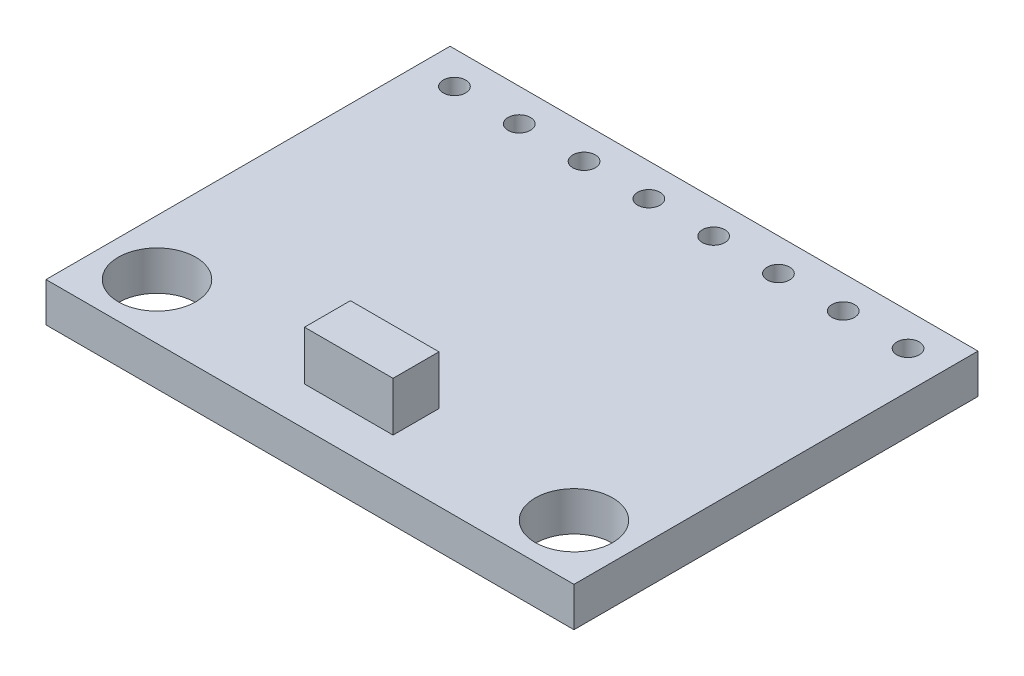
ISO-10303-21;
HEADER;
FILE_DESCRIPTION(('STEP AP214'),'2;1');
FILE_NAME('part.step','',(''),(''),'','','');
FILE_SCHEMA(('AUTOMOTIVE_DESIGN { 1 0 10303 214 1 1 1 1 }'));
ENDSEC;
DATA;
#1=APPLICATION_CONTEXT('core data for automotive mechanical design processes');
#2=APPLICATION_PROTOCOL_DEFINITION('international standard','automotive_design',2000,#1);
#3=PRODUCT_CONTEXT('',#1,'mechanical');
#4=PRODUCT('Part','Part','',(#3));
#5=PRODUCT_RELATED_PRODUCT_CATEGORY('part','',(#4));
#6=PRODUCT_DEFINITION_FORMATION('','',#4);
#7=PRODUCT_DEFINITION_CONTEXT('part definition',#1,'design');
#8=PRODUCT_DEFINITION('design','',#6,#7);
#9=PRODUCT_DEFINITION_SHAPE('','',#8);
#10=(LENGTH_UNIT() NAMED_UNIT(*) SI_UNIT(.MILLI.,.METRE.));
#11=(NAMED_UNIT(*) PLANE_ANGLE_UNIT() SI_UNIT($,.RADIAN.));
#12=(NAMED_UNIT(*) SI_UNIT($,.STERADIAN.) SOLID_ANGLE_UNIT());
#13=UNCERTAINTY_MEASURE_WITH_UNIT(LENGTH_MEASURE(1.E-05),#10,'distance_accuracy_value','');
#14=(GEOMETRIC_REPRESENTATION_CONTEXT(3) GLOBAL_UNCERTAINTY_ASSIGNED_CONTEXT((#13)) GLOBAL_UNIT_ASSIGNED_CONTEXT((#10,
#11,#12)) REPRESENTATION_CONTEXT('',''));
#15=CARTESIAN_POINT('',(0.,0.,0.));
#16=DIRECTION('',(0.,0.,1.));
#17=DIRECTION('',(1.,0.,0.));
#18=AXIS2_PLACEMENT_3D('',#15,#16,#17);
#19=CARTESIAN_POINT('',(0.,1.524,0.));
#20=DIRECTION('',(0.,-1.,0.));
#21=DIRECTION('',(0.,0.,-1.));
#22=AXIS2_PLACEMENT_3D('',#19,#20,#21);
#23=PLANE('',#22);
#24=CARTESIAN_POINT('',(19.005,1.524,-14.385));
#25=DIRECTION('',(0.,1.,0.));
#26=DIRECTION('',(0.,0.,1.));
#27=AXIS2_PLACEMENT_3D('',#24,#25,#26);
#28=CIRCLE('',#27,0.435);
#29=CARTESIAN_POINT('',(19.005,1.524,-13.95));
#30=VERTEX_POINT('',#29);
#31=EDGE_CURVE('E136',#30,#30,#28,.T.);
#32=ORIENTED_EDGE('',*,*,#31,.F.);
#33=EDGE_LOOP('',(#32));
#34=FACE_BOUND('',#33,.T.);
#35=CARTESIAN_POINT('',(16.495,1.524,-14.385));
#36=DIRECTION('',(0.,1.,0.));
#37=DIRECTION('',(0.,0.,1.));
#38=AXIS2_PLACEMENT_3D('',#35,#36,#37);
#39=CIRCLE('',#38,0.434999999999993);
#40=CARTESIAN_POINT('',(16.495,1.524,-13.95));
#41=VERTEX_POINT('',#40);
#42=EDGE_CURVE('E145',#41,#41,#39,.T.);
#43=ORIENTED_EDGE('',*,*,#42,.F.);
#44=EDGE_LOOP('',(#43));
#45=FACE_BOUND('',#44,.T.);
#46=CARTESIAN_POINT('',(3.94500000000001,1.524,-14.385));
#47=DIRECTION('',(0.,1.,0.));
#48=DIRECTION('',(0.,0.,1.));
#49=AXIS2_PLACEMENT_3D('',#46,#47,#48);
#50=CIRCLE('',#49,0.435000000000001);
#51=CARTESIAN_POINT('',(3.94500000000001,1.524,-13.95));
#52=VERTEX_POINT('',#51);
#53=EDGE_CURVE('E151',#52,#52,#50,.T.);
#54=ORIENTED_EDGE('',*,*,#53,.F.);
#55=EDGE_LOOP('',(#54));
#56=FACE_BOUND('',#55,.T.);
#57=CARTESIAN_POINT('',(11.475,1.524,-14.385));
#58=DIRECTION('',(0.,1.,0.));
#59=DIRECTION('',(0.,0.,1.));
#60=AXIS2_PLACEMENT_3D('',#57,#58,#59);
#61=CIRCLE('',#60,0.435);
#62=CARTESIAN_POINT('',(11.475,1.524,-13.95));
#63=VERTEX_POINT('',#62);
#64=EDGE_CURVE('E157',#63,#63,#61,.T.);
#65=ORIENTED_EDGE('',*,*,#64,.F.);
#66=EDGE_LOOP('',(#65));
#67=FACE_BOUND('',#66,.T.);
#68=CARTESIAN_POINT('',(13.985,1.524,-14.385));
#69=DIRECTION('',(0.,1.,0.));
#70=DIRECTION('',(0.,0.,1.));
#71=AXIS2_PLACEMENT_3D('',#68,#69,#70);
#72=CIRCLE('',#71,0.435);
#73=CARTESIAN_POINT('',(13.985,1.524,-13.95));
#74=VERTEX_POINT('',#73);
#75=EDGE_CURVE('E163',#74,#74,#72,.T.);
#76=ORIENTED_EDGE('',*,*,#75,.F.);
#77=EDGE_LOOP('',(#76));
#78=FACE_BOUND('',#77,.T.);
#79=CARTESIAN_POINT('',(6.45500000000001,1.524,-14.385));
#80=DIRECTION('',(0.,1.,0.));
#81=DIRECTION('',(0.,0.,1.));
#82=AXIS2_PLACEMENT_3D('',#79,#80,#81);
#83=CIRCLE('',#82,0.435);
#84=CARTESIAN_POINT('',(6.45500000000001,1.524,-13.95));
#85=VERTEX_POINT('',#84);
#86=EDGE_CURVE('E169',#85,#85,#83,.T.);
#87=ORIENTED_EDGE('',*,*,#86,.F.);
#88=EDGE_LOOP('',(#87));
#89=FACE_BOUND('',#88,.T.);
#90=CARTESIAN_POINT('',(1.43500000000001,1.524,-14.385));
#91=DIRECTION('',(0.,1.,0.));
#92=DIRECTION('',(0.,0.,1.));
#93=AXIS2_PLACEMENT_3D('',#90,#91,#92);
#94=CIRCLE('',#93,0.435);
#95=CARTESIAN_POINT('',(1.43500000000001,1.524,-13.95));
#96=VERTEX_POINT('',#95);
#97=EDGE_CURVE('E175',#96,#96,#94,.T.);
#98=ORIENTED_EDGE('',*,*,#97,.F.);
#99=EDGE_LOOP('',(#98));
#100=FACE_BOUND('',#99,.T.);
#101=CARTESIAN_POINT('',(8.96500000000001,1.524,-14.385));
#102=DIRECTION('',(0.,1.,0.));
#103=DIRECTION('',(0.,0.,1.));
#104=AXIS2_PLACEMENT_3D('',#101,#102,#103);
#105=CIRCLE('',#104,0.435);
#106=CARTESIAN_POINT('',(8.96500000000001,1.524,-13.95));
#107=VERTEX_POINT('',#106);
#108=EDGE_CURVE('E181',#107,#107,#105,.T.);
#109=ORIENTED_EDGE('',*,*,#108,.F.);
#110=EDGE_LOOP('',(#109));
#111=FACE_BOUND('',#110,.T.);
#112=CARTESIAN_POINT('',(18.3,1.524,-2.15));
#113=DIRECTION('',(0.,1.,0.));
#114=DIRECTION('',(0.,0.,1.));
#115=AXIS2_PLACEMENT_3D('',#112,#113,#114);
#116=CIRCLE('',#115,1.5);
#117=CARTESIAN_POINT('',(18.3,1.524,-0.650000000000001));
#118=VERTEX_POINT('',#117);
#119=EDGE_CURVE('E187',#118,#118,#116,.T.);
#120=ORIENTED_EDGE('',*,*,#119,.F.);
#121=EDGE_LOOP('',(#120));
#122=FACE_BOUND('',#121,.T.);
#123=CARTESIAN_POINT('',(2.15,1.524,-2.15));
#124=DIRECTION('',(0.,1.,0.));
#125=DIRECTION('',(0.,0.,1.));
#126=AXIS2_PLACEMENT_3D('',#123,#124,#125);
#127=CIRCLE('',#126,1.5);
#128=CARTESIAN_POINT('',(2.15,1.524,-0.65));
#129=VERTEX_POINT('',#128);
#130=EDGE_CURVE('E193',#129,#129,#127,.T.);
#131=ORIENTED_EDGE('',*,*,#130,.F.);
#132=EDGE_LOOP('',(#131));
#133=FACE_BOUND('',#132,.T.);
#134=DIRECTION('',(0.,0.,1.));
#135=VECTOR('',#134,1.);
#136=CARTESIAN_POINT('',(0.,1.524,0.));
#137=LINE('',#136,#135);
#138=CARTESIAN_POINT('',(0.,1.524,-15.65));
#139=VERTEX_POINT('',#138);
#140=CARTESIAN_POINT('',(0.,1.524,0.));
#141=VERTEX_POINT('',#140);
#142=EDGE_CURVE('E199',#139,#141,#137,.T.);
#143=ORIENTED_EDGE('',*,*,#142,.T.);
#144=DIRECTION('',(1.,0.,0.));
#145=VECTOR('',#144,1.);
#146=CARTESIAN_POINT('',(0.,1.524,0.));
#147=LINE('',#146,#145);
#148=CARTESIAN_POINT('',(20.45,1.524,0.));
#149=VERTEX_POINT('',#148);
#150=EDGE_CURVE('E202',#141,#149,#147,.T.);
#151=ORIENTED_EDGE('',*,*,#150,.T.);
#152=DIRECTION('',(0.,0.,-1.));
#153=VECTOR('',#152,1.);
#154=CARTESIAN_POINT('',(20.45,1.524,0.));
#155=LINE('',#154,#153);
#156=CARTESIAN_POINT('',(20.45,1.524,-15.65));
#157=VERTEX_POINT('',#156);
#158=EDGE_CURVE('E205',#149,#157,#155,.T.);
#159=ORIENTED_EDGE('',*,*,#158,.T.);
#160=DIRECTION('',(-1.,0.,0.));
#161=VECTOR('',#160,1.);
#162=CARTESIAN_POINT('',(0.,1.524,-15.65));
#163=LINE('',#162,#161);
#164=EDGE_CURVE('E207',#157,#139,#163,.T.);
#165=ORIENTED_EDGE('',*,*,#164,.T.);
#166=EDGE_LOOP('',(#143,#151,#159,#165));
#167=FACE_BOUND('',#166,.T.);
#168=DIRECTION('',(0.,0.,1.));
#169=VECTOR('',#168,1.);
#170=CARTESIAN_POINT('',(8.5105,1.524,-3.28036426337536));
#171=LINE('',#170,#169);
#172=CARTESIAN_POINT('',(8.5105,1.524,-3.28036426337536));
#173=VERTEX_POINT('',#172);
#174=CARTESIAN_POINT('',(8.5105,1.524,-1.50236426337536));
#175=VERTEX_POINT('',#174);
#176=EDGE_CURVE('E132',#173,#175,#171,.T.);
#177=ORIENTED_EDGE('',*,*,#176,.F.);
#178=DIRECTION('',(-1.,0.,0.));
#179=VECTOR('',#178,1.);
#180=CARTESIAN_POINT('',(8.5105,1.524,-3.28036426337536));
#181=LINE('',#180,#179);
#182=CARTESIAN_POINT('',(11.9395,1.524,-3.28036426337536));
#183=VERTEX_POINT('',#182);
#184=EDGE_CURVE('E129',#183,#173,#181,.T.);
#185=ORIENTED_EDGE('',*,*,#184,.F.);
#186=DIRECTION('',(0.,0.,-1.));
#187=VECTOR('',#186,1.);
#188=CARTESIAN_POINT('',(11.9395,1.524,-3.28036426337536));
#189=LINE('',#188,#187);
#190=CARTESIAN_POINT('',(11.9395,1.524,-1.50236426337536));
#191=VERTEX_POINT('',#190);
#192=EDGE_CURVE('E67',#191,#183,#189,.T.);
#193=ORIENTED_EDGE('',*,*,#192,.F.);
#194=DIRECTION('',(1.,0.,0.));
#195=VECTOR('',#194,1.);
#196=CARTESIAN_POINT('',(8.5105,1.524,-1.50236426337536));
#197=LINE('',#196,#195);
#198=EDGE_CURVE('E62',#175,#191,#197,.T.);
#199=ORIENTED_EDGE('',*,*,#198,.F.);
#200=EDGE_LOOP('',(#177,#185,#193,#199));
#201=FACE_BOUND('',#200,.T.);
#202=ADVANCED_FACE('F47',(#34,#45,#56,#67,#78,#89,#100,#111,#122,#133,#167,#201),#23,.F.);
#203=CARTESIAN_POINT('',(0.,0.,0.));
#204=DIRECTION('',(0.,-1.,0.));
#205=DIRECTION('',(0.,0.,-1.));
#206=AXIS2_PLACEMENT_3D('',#203,#204,#205);
#207=PLANE('',#206);
#208=CARTESIAN_POINT('',(16.495,0.,-14.385));
#209=DIRECTION('',(0.,1.,0.));
#210=DIRECTION('',(0.,0.,1.));
#211=AXIS2_PLACEMENT_3D('',#208,#209,#210);
#212=CIRCLE('',#211,0.434999999999993);
#213=CARTESIAN_POINT('',(16.495,0.,-13.95));
#214=VERTEX_POINT('',#213);
#215=EDGE_CURVE('E143',#214,#214,#212,.T.);
#216=ORIENTED_EDGE('',*,*,#215,.T.);
#217=EDGE_LOOP('',(#216));
#218=FACE_BOUND('',#217,.T.);
#219=CARTESIAN_POINT('',(11.475,0.,-14.385));
#220=DIRECTION('',(0.,1.,0.));
#221=DIRECTION('',(0.,0.,1.));
#222=AXIS2_PLACEMENT_3D('',#219,#220,#221);
#223=CIRCLE('',#222,0.435);
#224=CARTESIAN_POINT('',(11.475,0.,-13.95));
#225=VERTEX_POINT('',#224);
#226=EDGE_CURVE('E154',#225,#225,#223,.T.);
#227=ORIENTED_EDGE('',*,*,#226,.T.);
#228=EDGE_LOOP('',(#227));
#229=FACE_BOUND('',#228,.T.);
#230=CARTESIAN_POINT('',(6.45500000000001,0.,-14.385));
#231=DIRECTION('',(0.,1.,0.));
#232=DIRECTION('',(0.,0.,1.));
#233=AXIS2_PLACEMENT_3D('',#230,#231,#232);
#234=CIRCLE('',#233,0.435);
#235=CARTESIAN_POINT('',(6.45500000000001,0.,-13.95));
#236=VERTEX_POINT('',#235);
#237=EDGE_CURVE('E166',#236,#236,#234,.T.);
#238=ORIENTED_EDGE('',*,*,#237,.T.);
#239=EDGE_LOOP('',(#238));
#240=FACE_BOUND('',#239,.T.);
#241=CARTESIAN_POINT('',(8.96500000000001,0.,-14.385));
#242=DIRECTION('',(0.,1.,0.));
#243=DIRECTION('',(0.,0.,1.));
#244=AXIS2_PLACEMENT_3D('',#241,#242,#243);
#245=CIRCLE('',#244,0.435);
#246=CARTESIAN_POINT('',(8.96500000000001,0.,-13.95));
#247=VERTEX_POINT('',#246);
#248=EDGE_CURVE('E178',#247,#247,#245,.T.);
#249=ORIENTED_EDGE('',*,*,#248,.T.);
#250=EDGE_LOOP('',(#249));
#251=FACE_BOUND('',#250,.T.);
#252=CARTESIAN_POINT('',(2.15,0.,-2.15));
#253=DIRECTION('',(0.,1.,0.));
#254=DIRECTION('',(0.,0.,1.));
#255=AXIS2_PLACEMENT_3D('',#252,#253,#254);
#256=CIRCLE('',#255,1.5);
#257=CARTESIAN_POINT('',(2.15,0.,-0.65));
#258=VERTEX_POINT('',#257);
#259=EDGE_CURVE('E190',#258,#258,#256,.T.);
#260=ORIENTED_EDGE('',*,*,#259,.T.);
#261=EDGE_LOOP('',(#260));
#262=FACE_BOUND('',#261,.T.);
#263=DIRECTION('',(0.,0.,1.));
#264=VECTOR('',#263,1.);
#265=CARTESIAN_POINT('',(0.,0.,0.));
#266=LINE('',#265,#264);
#267=CARTESIAN_POINT('',(0.,0.,-15.65));
#268=VERTEX_POINT('',#267);
#269=CARTESIAN_POINT('',(0.,0.,0.));
#270=VERTEX_POINT('',#269);
#271=EDGE_CURVE('E196',#268,#270,#266,.T.);
#272=ORIENTED_EDGE('',*,*,#271,.F.);
#273=DIRECTION('',(-1.,0.,0.));
#274=VECTOR('',#273,1.);
#275=CARTESIAN_POINT('',(0.,0.,-15.65));
#276=LINE('',#275,#274);
#277=CARTESIAN_POINT('',(20.45,0.,-15.65));
#278=VERTEX_POINT('',#277);
#279=EDGE_CURVE('E203',#278,#268,#276,.T.);
#280=ORIENTED_EDGE('',*,*,#279,.F.);
#281=DIRECTION('',(0.,0.,-1.));
#282=VECTOR('',#281,1.);
#283=CARTESIAN_POINT('',(20.45,0.,0.));
#284=LINE('',#283,#282);
#285=CARTESIAN_POINT('',(20.45,0.,0.));
#286=VERTEX_POINT('',#285);
#287=EDGE_CURVE('E214',#286,#278,#284,.T.);
#288=ORIENTED_EDGE('',*,*,#287,.F.);
#289=DIRECTION('',(1.,0.,0.));
#290=VECTOR('',#289,1.);
#291=CARTESIAN_POINT('',(0.,0.,0.));
#292=LINE('',#291,#290);
#293=EDGE_CURVE('E212',#270,#286,#292,.T.);
#294=ORIENTED_EDGE('',*,*,#293,.F.);
#295=EDGE_LOOP('',(#272,#280,#288,#294));
#296=FACE_BOUND('',#295,.T.);
#297=CARTESIAN_POINT('',(18.3,0.,-2.15));
#298=DIRECTION('',(0.,1.,0.));
#299=DIRECTION('',(0.,0.,1.));
#300=AXIS2_PLACEMENT_3D('',#297,#298,#299);
#301=CIRCLE('',#300,1.5);
#302=CARTESIAN_POINT('',(18.3,0.,-0.650000000000001));
#303=VERTEX_POINT('',#302);
#304=EDGE_CURVE('E184',#303,#303,#301,.T.);
#305=ORIENTED_EDGE('',*,*,#304,.T.);
#306=EDGE_LOOP('',(#305));
#307=FACE_BOUND('',#306,.T.);
#308=CARTESIAN_POINT('',(1.43500000000001,0.,-14.385));
#309=DIRECTION('',(0.,1.,0.));
#310=DIRECTION('',(0.,0.,1.));
#311=AXIS2_PLACEMENT_3D('',#308,#309,#310);
#312=CIRCLE('',#311,0.435);
#313=CARTESIAN_POINT('',(1.43500000000001,0.,-13.95));
#314=VERTEX_POINT('',#313);
#315=EDGE_CURVE('E172',#314,#314,#312,.T.);
#316=ORIENTED_EDGE('',*,*,#315,.T.);
#317=EDGE_LOOP('',(#316));
#318=FACE_BOUND('',#317,.T.);
#319=CARTESIAN_POINT('',(13.985,0.,-14.385));
#320=DIRECTION('',(0.,1.,0.));
#321=DIRECTION('',(0.,0.,1.));
#322=AXIS2_PLACEMENT_3D('',#319,#320,#321);
#323=CIRCLE('',#322,0.435);
#324=CARTESIAN_POINT('',(13.985,0.,-13.95));
#325=VERTEX_POINT('',#324);
#326=EDGE_CURVE('E160',#325,#325,#323,.T.);
#327=ORIENTED_EDGE('',*,*,#326,.T.);
#328=EDGE_LOOP('',(#327));
#329=FACE_BOUND('',#328,.T.);
#330=CARTESIAN_POINT('',(3.94500000000001,0.,-14.385));
#331=DIRECTION('',(0.,1.,0.));
#332=DIRECTION('',(0.,0.,1.));
#333=AXIS2_PLACEMENT_3D('',#330,#331,#332);
#334=CIRCLE('',#333,0.435000000000001);
#335=CARTESIAN_POINT('',(3.94500000000001,0.,-13.95));
#336=VERTEX_POINT('',#335);
#337=EDGE_CURVE('E148',#336,#336,#334,.T.);
#338=ORIENTED_EDGE('',*,*,#337,.T.);
#339=EDGE_LOOP('',(#338));
#340=FACE_BOUND('',#339,.T.);
#341=CARTESIAN_POINT('',(19.005,0.,-14.385));
#342=DIRECTION('',(0.,1.,0.));
#343=DIRECTION('',(0.,0.,1.));
#344=AXIS2_PLACEMENT_3D('',#341,#342,#343);
#345=CIRCLE('',#344,0.435);
#346=CARTESIAN_POINT('',(19.005,0.,-13.95));
#347=VERTEX_POINT('',#346);
#348=EDGE_CURVE('E133',#347,#347,#345,.T.);
#349=ORIENTED_EDGE('',*,*,#348,.T.);
#350=EDGE_LOOP('',(#349));
#351=FACE_BOUND('',#350,.T.);
#352=ADVANCED_FACE('F232',(#218,#229,#240,#251,#262,#296,#307,#318,#329,#340,#351),#207,.T.);
#353=CARTESIAN_POINT('',(0.,1.524,0.));
#354=DIRECTION('',(1.,0.,0.));
#355=DIRECTION('',(0.,0.,-1.));
#356=AXIS2_PLACEMENT_3D('',#353,#354,#355);
#357=PLANE('',#356);
#358=ORIENTED_EDGE('',*,*,#271,.T.);
#359=DIRECTION('',(0.,-1.,0.));
#360=VECTOR('',#359,1.);
#361=CARTESIAN_POINT('',(0.,1.524,0.));
#362=LINE('',#361,#360);
#363=EDGE_CURVE('E11',#141,#270,#362,.T.);
#364=ORIENTED_EDGE('',*,*,#363,.F.);
#365=ORIENTED_EDGE('',*,*,#142,.F.);
#366=DIRECTION('',(0.,-1.,0.));
#367=VECTOR('',#366,1.);
#368=CARTESIAN_POINT('',(0.,1.524,-15.65));
#369=LINE('',#368,#367);
#370=EDGE_CURVE('E209',#139,#268,#369,.T.);
#371=ORIENTED_EDGE('',*,*,#370,.T.);
#372=EDGE_LOOP('',(#358,#364,#365,#371));
#373=FACE_BOUND('',#372,.T.);
#374=ADVANCED_FACE('F49',(#373),#357,.F.);
#375=CARTESIAN_POINT('',(0.,1.524,0.));
#376=DIRECTION('',(0.,0.,-1.));
#377=DIRECTION('',(-1.,0.,0.));
#378=AXIS2_PLACEMENT_3D('',#375,#376,#377);
#379=PLANE('',#378);
#380=ORIENTED_EDGE('',*,*,#293,.T.);
#381=DIRECTION('',(0.,-1.,0.));
#382=VECTOR('',#381,1.);
#383=CARTESIAN_POINT('',(20.45,1.524,0.));
#384=LINE('',#383,#382);
#385=EDGE_CURVE('E55',#149,#286,#384,.T.);
#386=ORIENTED_EDGE('',*,*,#385,.F.);
#387=ORIENTED_EDGE('',*,*,#150,.F.);
#388=ORIENTED_EDGE('',*,*,#363,.T.);
#389=EDGE_LOOP('',(#380,#386,#387,#388));
#390=FACE_BOUND('',#389,.T.);
#391=ADVANCED_FACE('F242',(#390),#379,.F.);
#392=CARTESIAN_POINT('',(20.45,1.524,0.));
#393=DIRECTION('',(-1.,0.,0.));
#394=DIRECTION('',(0.,0.,1.));
#395=AXIS2_PLACEMENT_3D('',#392,#393,#394);
#396=PLANE('',#395);
#397=ORIENTED_EDGE('',*,*,#287,.T.);
#398=DIRECTION('',(0.,-1.,0.));
#399=VECTOR('',#398,1.);
#400=CARTESIAN_POINT('',(20.45,1.524,-15.65));
#401=LINE('',#400,#399);
#402=EDGE_CURVE('E219',#157,#278,#401,.T.);
#403=ORIENTED_EDGE('',*,*,#402,.F.);
#404=ORIENTED_EDGE('',*,*,#158,.F.);
#405=ORIENTED_EDGE('',*,*,#385,.T.);
#406=EDGE_LOOP('',(#397,#403,#404,#405));
#407=FACE_BOUND('',#406,.T.);
#408=ADVANCED_FACE('F226',(#407),#396,.F.);
#409=CARTESIAN_POINT('',(0.,1.524,-15.65));
#410=DIRECTION('',(0.,0.,1.));
#411=DIRECTION('',(1.,0.,0.));
#412=AXIS2_PLACEMENT_3D('',#409,#410,#411);
#413=PLANE('',#412);
#414=ORIENTED_EDGE('',*,*,#279,.T.);
#415=ORIENTED_EDGE('',*,*,#370,.F.);
#416=ORIENTED_EDGE('',*,*,#164,.F.);
#417=ORIENTED_EDGE('',*,*,#402,.T.);
#418=EDGE_LOOP('',(#414,#415,#416,#417));
#419=FACE_BOUND('',#418,.T.);
#420=ADVANCED_FACE('F236',(#419),#413,.F.);
#421=CARTESIAN_POINT('',(2.15,1.524,-2.15));
#422=DIRECTION('',(0.,-1.,0.));
#423=DIRECTION('',(0.,0.,-1.));
#424=AXIS2_PLACEMENT_3D('',#421,#422,#423);
#425=CYLINDRICAL_SURFACE('',#424,1.5);
#426=ORIENTED_EDGE('',*,*,#130,.T.);
#427=EDGE_LOOP('',(#426));
#428=FACE_BOUND('',#427,.T.);
#429=ORIENTED_EDGE('',*,*,#259,.F.);
#430=EDGE_LOOP('',(#429));
#431=FACE_BOUND('',#430,.T.);
#432=ADVANCED_FACE('F262',(#428,#431),#425,.F.);
#433=CARTESIAN_POINT('',(18.3,1.524,-2.15));
#434=DIRECTION('',(0.,-1.,0.));
#435=DIRECTION('',(0.,0.,-1.));
#436=AXIS2_PLACEMENT_3D('',#433,#434,#435);
#437=CYLINDRICAL_SURFACE('',#436,1.5);
#438=ORIENTED_EDGE('',*,*,#119,.T.);
#439=EDGE_LOOP('',(#438));
#440=FACE_BOUND('',#439,.T.);
#441=ORIENTED_EDGE('',*,*,#304,.F.);
#442=EDGE_LOOP('',(#441));
#443=FACE_BOUND('',#442,.T.);
#444=ADVANCED_FACE('F269',(#440,#443),#437,.F.);
#445=CARTESIAN_POINT('',(8.96500000000001,1.524,-14.385));
#446=DIRECTION('',(0.,-1.,0.));
#447=DIRECTION('',(0.,0.,-1.));
#448=AXIS2_PLACEMENT_3D('',#445,#446,#447);
#449=CYLINDRICAL_SURFACE('',#448,0.435);
#450=ORIENTED_EDGE('',*,*,#108,.T.);
#451=EDGE_LOOP('',(#450));
#452=FACE_BOUND('',#451,.T.);
#453=ORIENTED_EDGE('',*,*,#248,.F.);
#454=EDGE_LOOP('',(#453));
#455=FACE_BOUND('',#454,.T.);
#456=ADVANCED_FACE('F274',(#452,#455),#449,.F.);
#457=CARTESIAN_POINT('',(1.43500000000001,1.524,-14.385));
#458=DIRECTION('',(0.,-1.,0.));
#459=DIRECTION('',(0.,0.,-1.));
#460=AXIS2_PLACEMENT_3D('',#457,#458,#459);
#461=CYLINDRICAL_SURFACE('',#460,0.435);
#462=ORIENTED_EDGE('',*,*,#97,.T.);
#463=EDGE_LOOP('',(#462));
#464=FACE_BOUND('',#463,.T.);
#465=ORIENTED_EDGE('',*,*,#315,.F.);
#466=EDGE_LOOP('',(#465));
#467=FACE_BOUND('',#466,.T.);
#468=ADVANCED_FACE('F284',(#464,#467),#461,.F.);
#469=CARTESIAN_POINT('',(6.45500000000001,1.524,-14.385));
#470=DIRECTION('',(0.,-1.,0.));
#471=DIRECTION('',(0.,0.,-1.));
#472=AXIS2_PLACEMENT_3D('',#469,#470,#471);
#473=CYLINDRICAL_SURFACE('',#472,0.435);
#474=ORIENTED_EDGE('',*,*,#86,.T.);
#475=EDGE_LOOP('',(#474));
#476=FACE_BOUND('',#475,.T.);
#477=ORIENTED_EDGE('',*,*,#237,.F.);
#478=EDGE_LOOP('',(#477));
#479=FACE_BOUND('',#478,.T.);
#480=ADVANCED_FACE('F291',(#476,#479),#473,.F.);
#481=CARTESIAN_POINT('',(13.985,1.524,-14.385));
#482=DIRECTION('',(0.,-1.,0.));
#483=DIRECTION('',(0.,0.,-1.));
#484=AXIS2_PLACEMENT_3D('',#481,#482,#483);
#485=CYLINDRICAL_SURFACE('',#484,0.435);
#486=ORIENTED_EDGE('',*,*,#75,.T.);
#487=EDGE_LOOP('',(#486));
#488=FACE_BOUND('',#487,.T.);
#489=ORIENTED_EDGE('',*,*,#326,.F.);
#490=EDGE_LOOP('',(#489));
#491=FACE_BOUND('',#490,.T.);
#492=ADVANCED_FACE('F295',(#488,#491),#485,.F.);
#493=CARTESIAN_POINT('',(11.475,1.524,-14.385));
#494=DIRECTION('',(0.,-1.,0.));
#495=DIRECTION('',(0.,0.,-1.));
#496=AXIS2_PLACEMENT_3D('',#493,#494,#495);
#497=CYLINDRICAL_SURFACE('',#496,0.435);
#498=ORIENTED_EDGE('',*,*,#64,.T.);
#499=EDGE_LOOP('',(#498));
#500=FACE_BOUND('',#499,.T.);
#501=ORIENTED_EDGE('',*,*,#226,.F.);
#502=EDGE_LOOP('',(#501));
#503=FACE_BOUND('',#502,.T.);
#504=ADVANCED_FACE('F299',(#500,#503),#497,.F.);
#505=CARTESIAN_POINT('',(3.94500000000001,1.524,-14.385));
#506=DIRECTION('',(0.,-1.,0.));
#507=DIRECTION('',(0.,0.,-1.));
#508=AXIS2_PLACEMENT_3D('',#505,#506,#507);
#509=CYLINDRICAL_SURFACE('',#508,0.435000000000001);
#510=ORIENTED_EDGE('',*,*,#53,.T.);
#511=EDGE_LOOP('',(#510));
#512=FACE_BOUND('',#511,.T.);
#513=ORIENTED_EDGE('',*,*,#337,.F.);
#514=EDGE_LOOP('',(#513));
#515=FACE_BOUND('',#514,.T.);
#516=ADVANCED_FACE('F303',(#512,#515),#509,.F.);
#517=CARTESIAN_POINT('',(16.495,1.524,-14.385));
#518=DIRECTION('',(0.,-1.,0.));
#519=DIRECTION('',(0.,0.,-1.));
#520=AXIS2_PLACEMENT_3D('',#517,#518,#519);
#521=CYLINDRICAL_SURFACE('',#520,0.434999999999993);
#522=ORIENTED_EDGE('',*,*,#42,.T.);
#523=EDGE_LOOP('',(#522));
#524=FACE_BOUND('',#523,.T.);
#525=ORIENTED_EDGE('',*,*,#215,.F.);
#526=EDGE_LOOP('',(#525));
#527=FACE_BOUND('',#526,.T.);
#528=ADVANCED_FACE('F307',(#524,#527),#521,.F.);
#529=CARTESIAN_POINT('',(19.005,1.524,-14.385));
#530=DIRECTION('',(0.,-1.,0.));
#531=DIRECTION('',(0.,0.,-1.));
#532=AXIS2_PLACEMENT_3D('',#529,#530,#531);
#533=CYLINDRICAL_SURFACE('',#532,0.435);
#534=ORIENTED_EDGE('',*,*,#31,.T.);
#535=EDGE_LOOP('',(#534));
#536=FACE_BOUND('',#535,.T.);
#537=ORIENTED_EDGE('',*,*,#348,.F.);
#538=EDGE_LOOP('',(#537));
#539=FACE_BOUND('',#538,.T.);
#540=ADVANCED_FACE('F311',(#536,#539),#533,.F.);
#541=CARTESIAN_POINT('',(8.5105,3.429,-3.28036426337536));
#542=DIRECTION('',(1.,0.,0.));
#543=DIRECTION('',(0.,0.,-1.));
#544=AXIS2_PLACEMENT_3D('',#541,#542,#543);
#545=PLANE('',#544);
#546=ORIENTED_EDGE('',*,*,#176,.T.);
#547=DIRECTION('',(0.,-1.,0.));
#548=VECTOR('',#547,1.);
#549=CARTESIAN_POINT('',(8.5105,3.429,-1.50236426337536));
#550=LINE('',#549,#548);
#551=CARTESIAN_POINT('',(8.5105,3.429,-1.50236426337536));
#552=VERTEX_POINT('',#551);
#553=EDGE_CURVE('E113',#552,#175,#550,.T.);
#554=ORIENTED_EDGE('',*,*,#553,.F.);
#555=DIRECTION('',(0.,0.,1.));
#556=VECTOR('',#555,1.);
#557=CARTESIAN_POINT('',(8.5105,3.429,-3.28036426337536));
#558=LINE('',#557,#556);
#559=CARTESIAN_POINT('',(8.5105,3.429,-3.28036426337536));
#560=VERTEX_POINT('',#559);
#561=EDGE_CURVE('E120',#560,#552,#558,.T.);
#562=ORIENTED_EDGE('',*,*,#561,.F.);
#563=DIRECTION('',(0.,-1.,0.));
#564=VECTOR('',#563,1.);
#565=CARTESIAN_POINT('',(8.5105,3.429,-3.28036426337536));
#566=LINE('',#565,#564);
#567=EDGE_CURVE('E475',#560,#173,#566,.T.);
#568=ORIENTED_EDGE('',*,*,#567,.T.);
#569=EDGE_LOOP('',(#546,#554,#562,#568));
#570=FACE_BOUND('',#569,.T.);
#571=ADVANCED_FACE('F131',(#570),#545,.F.);
#572=CARTESIAN_POINT('',(8.5105,3.429,-1.50236426337536));
#573=DIRECTION('',(0.,0.,-1.));
#574=DIRECTION('',(-1.,0.,0.));
#575=AXIS2_PLACEMENT_3D('',#572,#573,#574);
#576=PLANE('',#575);
#577=ORIENTED_EDGE('',*,*,#198,.T.);
#578=DIRECTION('',(0.,-1.,0.));
#579=VECTOR('',#578,1.);
#580=CARTESIAN_POINT('',(11.9395,3.429,-1.50236426337536));
#581=LINE('',#580,#579);
#582=CARTESIAN_POINT('',(11.9395,3.429,-1.50236426337536));
#583=VERTEX_POINT('',#582);
#584=EDGE_CURVE('E116',#583,#191,#581,.T.);
#585=ORIENTED_EDGE('',*,*,#584,.F.);
#586=DIRECTION('',(1.,0.,0.));
#587=VECTOR('',#586,1.);
#588=CARTESIAN_POINT('',(8.5105,3.429,-1.50236426337536));
#589=LINE('',#588,#587);
#590=EDGE_CURVE('E109',#552,#583,#589,.T.);
#591=ORIENTED_EDGE('',*,*,#590,.F.);
#592=ORIENTED_EDGE('',*,*,#553,.T.);
#593=EDGE_LOOP('',(#577,#585,#591,#592));
#594=FACE_BOUND('',#593,.T.);
#595=ADVANCED_FACE('F111',(#594),#576,.F.);
#596=CARTESIAN_POINT('',(11.9395,3.429,-3.28036426337536));
#597=DIRECTION('',(-1.,0.,0.));
#598=DIRECTION('',(0.,0.,1.));
#599=AXIS2_PLACEMENT_3D('',#596,#597,#598);
#600=PLANE('',#599);
#601=ORIENTED_EDGE('',*,*,#192,.T.);
#602=DIRECTION('',(0.,-1.,0.));
#603=VECTOR('',#602,1.);
#604=CARTESIAN_POINT('',(11.9395,3.429,-3.28036426337536));
#605=LINE('',#604,#603);
#606=CARTESIAN_POINT('',(11.9395,3.429,-3.28036426337536));
#607=VERTEX_POINT('',#606);
#608=EDGE_CURVE('E138',#607,#183,#605,.T.);
#609=ORIENTED_EDGE('',*,*,#608,.F.);
#610=DIRECTION('',(0.,0.,-1.));
#611=VECTOR('',#610,1.);
#612=CARTESIAN_POINT('',(11.9395,3.429,-3.28036426337536));
#613=LINE('',#612,#611);
#614=EDGE_CURVE('E119',#583,#607,#613,.T.);
#615=ORIENTED_EDGE('',*,*,#614,.F.);
#616=ORIENTED_EDGE('',*,*,#584,.T.);
#617=EDGE_LOOP('',(#601,#609,#615,#616));
#618=FACE_BOUND('',#617,.T.);
#619=ADVANCED_FACE('F319',(#618),#600,.F.);
#620=CARTESIAN_POINT('',(8.5105,3.429,-3.28036426337536));
#621=DIRECTION('',(0.,0.,1.));
#622=DIRECTION('',(1.,0.,0.));
#623=AXIS2_PLACEMENT_3D('',#620,#621,#622);
#624=PLANE('',#623);
#625=ORIENTED_EDGE('',*,*,#184,.T.);
#626=ORIENTED_EDGE('',*,*,#567,.F.);
#627=DIRECTION('',(-1.,0.,0.));
#628=VECTOR('',#627,1.);
#629=CARTESIAN_POINT('',(8.5105,3.429,-3.28036426337536));
#630=LINE('',#629,#628);
#631=EDGE_CURVE('E125',#607,#560,#630,.T.);
#632=ORIENTED_EDGE('',*,*,#631,.F.);
#633=ORIENTED_EDGE('',*,*,#608,.T.);
#634=EDGE_LOOP('',(#625,#626,#632,#633));
#635=FACE_BOUND('',#634,.T.);
#636=ADVANCED_FACE('F322',(#635),#624,.F.);
#637=CARTESIAN_POINT('',(0.,3.429,0.));
#638=DIRECTION('',(0.,1.,0.));
#639=DIRECTION('',(0.,0.,1.));
#640=AXIS2_PLACEMENT_3D('',#637,#638,#639);
#641=PLANE('',#640);
#642=ORIENTED_EDGE('',*,*,#561,.T.);
#643=ORIENTED_EDGE('',*,*,#590,.T.);
#644=ORIENTED_EDGE('',*,*,#614,.T.);
#645=ORIENTED_EDGE('',*,*,#631,.T.);
#646=EDGE_LOOP('',(#642,#643,#644,#645));
#647=FACE_BOUND('',#646,.T.);
#648=ADVANCED_FACE('F123',(#647),#641,.T.);
#649=CLOSED_SHELL('',(#202,#352,#374,#391,#408,#420,#432,#444,#456,#468,#480,#492,#504,#516,
#528,#540,#571,#595,#619,#636,#648));
#650=MANIFOLD_SOLID_BREP('B2',#649);
#651=ADVANCED_BREP_SHAPE_REPRESENTATION('',(#18,#650),#14);
#652=SHAPE_DEFINITION_REPRESENTATION(#9,#651);
ENDSEC;
END-ISO-10303-21;
